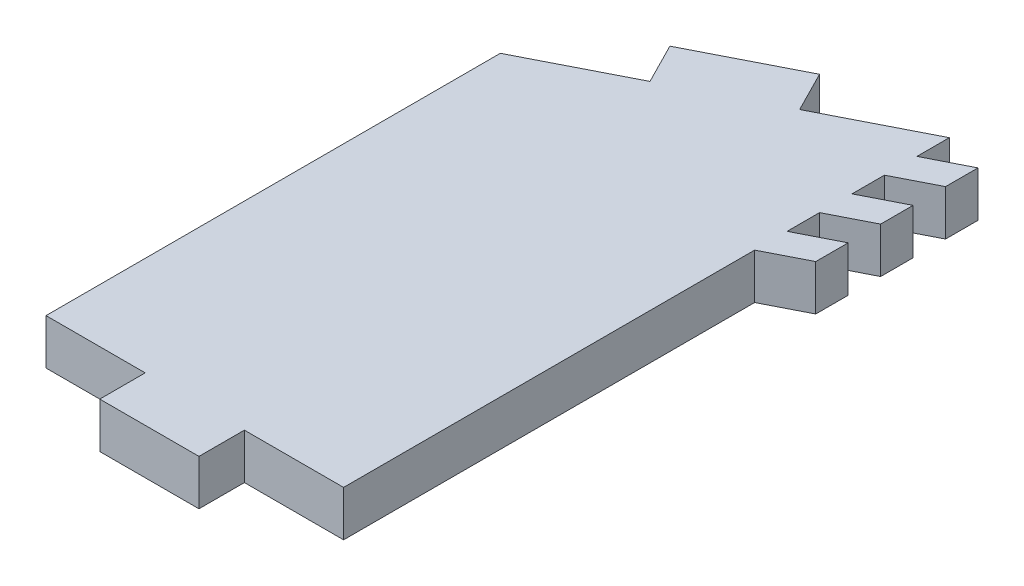
ISO-10303-21;
HEADER;
FILE_DESCRIPTION(('STEP AP214'),'2;1');
FILE_NAME('part.step','',(''),(''),'','','');
FILE_SCHEMA(('AUTOMOTIVE_DESIGN { 1 0 10303 214 1 1 1 1 }'));
ENDSEC;
DATA;
#1=APPLICATION_CONTEXT('core data for automotive mechanical design processes');
#2=APPLICATION_PROTOCOL_DEFINITION('international standard','automotive_design',2000,#1);
#3=PRODUCT_CONTEXT('',#1,'mechanical');
#4=PRODUCT('Part','Part','',(#3));
#5=PRODUCT_RELATED_PRODUCT_CATEGORY('part','',(#4));
#6=PRODUCT_DEFINITION_FORMATION('','',#4);
#7=PRODUCT_DEFINITION_CONTEXT('part definition',#1,'design');
#8=PRODUCT_DEFINITION('design','',#6,#7);
#9=PRODUCT_DEFINITION_SHAPE('','',#8);
#10=(LENGTH_UNIT() NAMED_UNIT(*) SI_UNIT(.MILLI.,.METRE.));
#11=(NAMED_UNIT(*) PLANE_ANGLE_UNIT() SI_UNIT($,.RADIAN.));
#12=(NAMED_UNIT(*) SI_UNIT($,.STERADIAN.) SOLID_ANGLE_UNIT());
#13=UNCERTAINTY_MEASURE_WITH_UNIT(LENGTH_MEASURE(1.E-05),#10,'distance_accuracy_value','');
#14=(GEOMETRIC_REPRESENTATION_CONTEXT(3) GLOBAL_UNCERTAINTY_ASSIGNED_CONTEXT((#13)) GLOBAL_UNIT_ASSIGNED_CONTEXT((#10,
#11,#12)) REPRESENTATION_CONTEXT('',''));
#15=CARTESIAN_POINT('',(0.,0.,0.));
#16=DIRECTION('',(0.,0.,1.));
#17=DIRECTION('',(1.,0.,0.));
#18=AXIS2_PLACEMENT_3D('',#15,#16,#17);
#19=CARTESIAN_POINT('',(19.65,3.,-40.));
#20=DIRECTION('',(-1.,0.,0.));
#21=DIRECTION('',(0.,0.,1.));
#22=AXIS2_PLACEMENT_3D('',#19,#20,#21);
#23=PLANE('',#22);
#24=DIRECTION('',(0.,0.,-1.));
#25=VECTOR('',#24,1.);
#26=CARTESIAN_POINT('',(19.65,0.,-40.));
#27=LINE('',#26,#25);
#28=CARTESIAN_POINT('',(19.65,0.,-33.5714281428571));
#29=VERTEX_POINT('',#28);
#30=CARTESIAN_POINT('',(19.65,0.,-35.7142851428571));
#31=VERTEX_POINT('',#30);
#32=EDGE_CURVE('E440',#29,#31,#27,.T.);
#33=ORIENTED_EDGE('',*,*,#32,.T.);
#34=DIRECTION('',(0.,-1.,0.));
#35=VECTOR('',#34,1.);
#36=CARTESIAN_POINT('',(19.65,3.,-35.7142851428571));
#37=LINE('',#36,#35);
#38=CARTESIAN_POINT('',(19.65,3.,-35.7142851428571));
#39=VERTEX_POINT('',#38);
#40=EDGE_CURVE('E67',#39,#31,#37,.T.);
#41=ORIENTED_EDGE('',*,*,#40,.F.);
#42=DIRECTION('',(0.,0.,-1.));
#43=VECTOR('',#42,1.);
#44=CARTESIAN_POINT('',(19.65,3.,0.));
#45=LINE('',#44,#43);
#46=CARTESIAN_POINT('',(19.65,3.,-33.5714281428571));
#47=VERTEX_POINT('',#46);
#48=EDGE_CURVE('E438',#47,#39,#45,.T.);
#49=ORIENTED_EDGE('',*,*,#48,.F.);
#50=DIRECTION('',(0.,-1.,0.));
#51=VECTOR('',#50,1.);
#52=CARTESIAN_POINT('',(19.65,3.,-33.5714281428571));
#53=LINE('',#52,#51);
#54=EDGE_CURVE('E240',#47,#29,#53,.T.);
#55=ORIENTED_EDGE('',*,*,#54,.T.);
#56=EDGE_LOOP('',(#33,#41,#49,#55));
#57=FACE_BOUND('',#56,.T.);
#58=ADVANCED_FACE('F44',(#57),#23,.F.);
#59=CARTESIAN_POINT('',(19.65,0.,-29.2857141428571));
#60=VERTEX_POINT('',#59);
#61=CARTESIAN_POINT('',(19.65,0.,-31.4285711428571));
#62=VERTEX_POINT('',#61);
#63=EDGE_CURVE('E374',#60,#62,#27,.T.);
#64=ORIENTED_EDGE('',*,*,#63,.T.);
#65=DIRECTION('',(0.,-1.,0.));
#66=VECTOR('',#65,1.);
#67=CARTESIAN_POINT('',(19.65,3.,-31.4285711428571));
#68=LINE('',#67,#66);
#69=CARTESIAN_POINT('',(19.65,3.,-31.4285711428571));
#70=VERTEX_POINT('',#69);
#71=EDGE_CURVE('E235',#70,#62,#68,.T.);
#72=ORIENTED_EDGE('',*,*,#71,.F.);
#73=CARTESIAN_POINT('',(19.65,3.,-29.2857141428571));
#74=VERTEX_POINT('',#73);
#75=EDGE_CURVE('E358',#74,#70,#45,.T.);
#76=ORIENTED_EDGE('',*,*,#75,.F.);
#77=DIRECTION('',(0.,-1.,0.));
#78=VECTOR('',#77,1.);
#79=CARTESIAN_POINT('',(19.65,3.,-29.2857141428571));
#80=LINE('',#79,#78);
#81=EDGE_CURVE('E294',#74,#60,#80,.T.);
#82=ORIENTED_EDGE('',*,*,#81,.T.);
#83=EDGE_LOOP('',(#64,#72,#76,#82));
#84=FACE_BOUND('',#83,.T.);
#85=ADVANCED_FACE('F463',(#84),#23,.F.);
#86=CARTESIAN_POINT('',(0.,3.,0.));
#87=DIRECTION('',(0.,0.,-1.));
#88=DIRECTION('',(-1.,0.,0.));
#89=AXIS2_PLACEMENT_3D('',#86,#87,#88);
#90=PLANE('',#89);
#91=DIRECTION('',(0.,-1.,0.));
#92=VECTOR('',#91,1.);
#93=CARTESIAN_POINT('',(6.55,3.,0.));
#94=LINE('',#93,#92);
#95=CARTESIAN_POINT('',(6.55,3.,0.));
#96=VERTEX_POINT('',#95);
#97=CARTESIAN_POINT('',(6.55,0.,0.));
#98=VERTEX_POINT('',#97);
#99=EDGE_CURVE('E260',#96,#98,#94,.T.);
#100=ORIENTED_EDGE('',*,*,#99,.F.);
#101=DIRECTION('',(1.,0.,0.));
#102=VECTOR('',#101,1.);
#103=CARTESIAN_POINT('',(0.,3.,0.));
#104=LINE('',#103,#102);
#105=CARTESIAN_POINT('',(0.,3.,0.));
#106=VERTEX_POINT('',#105);
#107=EDGE_CURVE('E351',#106,#96,#104,.T.);
#108=ORIENTED_EDGE('',*,*,#107,.F.);
#109=DIRECTION('',(0.,-1.,0.));
#110=VECTOR('',#109,1.);
#111=CARTESIAN_POINT('',(0.,3.,0.));
#112=LINE('',#111,#110);
#113=CARTESIAN_POINT('',(0.,0.,0.));
#114=VERTEX_POINT('',#113);
#115=EDGE_CURVE('E11',#106,#114,#112,.T.);
#116=ORIENTED_EDGE('',*,*,#115,.T.);
#117=DIRECTION('',(1.,0.,0.));
#118=VECTOR('',#117,1.);
#119=CARTESIAN_POINT('',(0.,0.,0.));
#120=LINE('',#119,#118);
#121=EDGE_CURVE('E366',#114,#98,#120,.T.);
#122=ORIENTED_EDGE('',*,*,#121,.T.);
#123=EDGE_LOOP('',(#100,#108,#116,#122));
#124=FACE_BOUND('',#123,.T.);
#125=ADVANCED_FACE('F412',(#124),#90,.F.);
#126=DIRECTION('',(0.,-1.,0.));
#127=VECTOR('',#126,1.);
#128=CARTESIAN_POINT('',(19.65,3.,-27.1428571428571));
#129=LINE('',#128,#127);
#130=CARTESIAN_POINT('',(19.65,3.,-27.1428571428571));
#131=VERTEX_POINT('',#130);
#132=CARTESIAN_POINT('',(19.65,0.,-27.1428571428571));
#133=VERTEX_POINT('',#132);
#134=EDGE_CURVE('E287',#131,#133,#129,.T.);
#135=ORIENTED_EDGE('',*,*,#134,.F.);
#136=CARTESIAN_POINT('',(19.65,3.,0.));
#137=VERTEX_POINT('',#136);
#138=EDGE_CURVE('E354',#137,#131,#45,.T.);
#139=ORIENTED_EDGE('',*,*,#138,.F.);
#140=DIRECTION('',(0.,-1.,0.));
#141=VECTOR('',#140,1.);
#142=CARTESIAN_POINT('',(19.65,3.,0.));
#143=LINE('',#142,#141);
#144=CARTESIAN_POINT('',(19.65,0.,0.));
#145=VERTEX_POINT('',#144);
#146=EDGE_CURVE('E52',#137,#145,#143,.T.);
#147=ORIENTED_EDGE('',*,*,#146,.T.);
#148=EDGE_CURVE('E370',#145,#133,#27,.T.);
#149=ORIENTED_EDGE('',*,*,#148,.T.);
#150=EDGE_LOOP('',(#135,#139,#147,#149));
#151=FACE_BOUND('',#150,.T.);
#152=ADVANCED_FACE('F386',(#151),#23,.F.);
#153=CARTESIAN_POINT('',(0.,3.,-30.));
#154=DIRECTION('',(0.453552054603838,0.,0.891229787296541));
#155=DIRECTION('',(0.891229787296541,0.,-0.453552054603838));
#156=AXIS2_PLACEMENT_3D('',#153,#154,#155);
#157=PLANE('',#156);
#158=DIRECTION('',(0.,-1.,0.));
#159=VECTOR('',#158,1.);
#160=CARTESIAN_POINT('',(13.0994610633704,3.,-36.6663923986618));
#161=LINE('',#160,#159);
#162=CARTESIAN_POINT('',(13.0994610633704,3.,-36.6663923986618));
#163=VERTEX_POINT('',#162);
#164=CARTESIAN_POINT('',(13.0994610633704,0.,-36.6663923986618));
#165=VERTEX_POINT('',#164);
#166=EDGE_CURVE('E337',#163,#165,#161,.T.);
#167=ORIENTED_EDGE('',*,*,#166,.F.);
#168=DIRECTION('',(-0.891229787296541,0.,0.453552054603838));
#169=VECTOR('',#168,1.);
#170=CARTESIAN_POINT('',(0.,3.,-30.));
#171=LINE('',#170,#169);
#172=CARTESIAN_POINT('',(19.65,3.,-40.));
#173=VERTEX_POINT('',#172);
#174=EDGE_CURVE('E359',#173,#163,#171,.T.);
#175=ORIENTED_EDGE('',*,*,#174,.F.);
#176=DIRECTION('',(0.,-1.,0.));
#177=VECTOR('',#176,1.);
#178=CARTESIAN_POINT('',(19.65,3.,-40.));
#179=LINE('',#178,#177);
#180=CARTESIAN_POINT('',(19.65,0.,-40.));
#181=VERTEX_POINT('',#180);
#182=EDGE_CURVE('E379',#173,#181,#179,.T.);
#183=ORIENTED_EDGE('',*,*,#182,.T.);
#184=DIRECTION('',(-0.891229787296541,0.,0.453552054603838));
#185=VECTOR('',#184,1.);
#186=CARTESIAN_POINT('',(0.,0.,-30.));
#187=LINE('',#186,#185);
#188=EDGE_CURVE('E350',#181,#165,#187,.T.);
#189=ORIENTED_EDGE('',*,*,#188,.T.);
#190=EDGE_LOOP('',(#167,#175,#183,#189));
#191=FACE_BOUND('',#190,.T.);
#192=ADVANCED_FACE('F436',(#191),#157,.F.);
#193=CARTESIAN_POINT('',(0.,3.,0.));
#194=DIRECTION('',(1.,0.,0.));
#195=DIRECTION('',(0.,0.,-1.));
#196=AXIS2_PLACEMENT_3D('',#193,#194,#195);
#197=PLANE('',#196);
#198=DIRECTION('',(0.,0.,1.));
#199=VECTOR('',#198,1.);
#200=CARTESIAN_POINT('',(0.,0.,0.));
#201=LINE('',#200,#199);
#202=CARTESIAN_POINT('',(0.,0.,-30.));
#203=VERTEX_POINT('',#202);
#204=EDGE_CURVE('E339',#203,#114,#201,.T.);
#205=ORIENTED_EDGE('',*,*,#204,.T.);
#206=ORIENTED_EDGE('',*,*,#115,.F.);
#207=DIRECTION('',(0.,0.,1.));
#208=VECTOR('',#207,1.);
#209=CARTESIAN_POINT('',(0.,3.,0.));
#210=LINE('',#209,#208);
#211=CARTESIAN_POINT('',(0.,3.,-30.));
#212=VERTEX_POINT('',#211);
#213=EDGE_CURVE('E346',#212,#106,#210,.T.);
#214=ORIENTED_EDGE('',*,*,#213,.F.);
#215=DIRECTION('',(0.,-1.,0.));
#216=VECTOR('',#215,1.);
#217=CARTESIAN_POINT('',(0.,3.,-30.));
#218=LINE('',#217,#216);
#219=EDGE_CURVE('E362',#212,#203,#218,.T.);
#220=ORIENTED_EDGE('',*,*,#219,.T.);
#221=EDGE_LOOP('',(#205,#206,#214,#220));
#222=FACE_BOUND('',#221,.T.);
#223=ADVANCED_FACE('F46',(#222),#197,.F.);
#224=CARTESIAN_POINT('',(13.1,3.,0.));
#225=VERTEX_POINT('',#224);
#226=EDGE_CURVE('E349',#225,#137,#104,.T.);
#227=ORIENTED_EDGE('',*,*,#226,.F.);
#228=DIRECTION('',(0.,-1.,0.));
#229=VECTOR('',#228,1.);
#230=CARTESIAN_POINT('',(13.1,3.,0.));
#231=LINE('',#230,#229);
#232=CARTESIAN_POINT('',(13.1,0.,0.));
#233=VERTEX_POINT('',#232);
#234=EDGE_CURVE('E268',#225,#233,#231,.T.);
#235=ORIENTED_EDGE('',*,*,#234,.T.);
#236=EDGE_CURVE('E365',#233,#145,#120,.T.);
#237=ORIENTED_EDGE('',*,*,#236,.T.);
#238=ORIENTED_EDGE('',*,*,#146,.F.);
#239=EDGE_LOOP('',(#227,#235,#237,#238));
#240=FACE_BOUND('',#239,.T.);
#241=ADVANCED_FACE('F390',(#240),#90,.F.);
#242=CARTESIAN_POINT('',(19.65,3.,-37.8571421428571));
#243=VERTEX_POINT('',#242);
#244=EDGE_CURVE('E59',#243,#173,#45,.T.);
#245=ORIENTED_EDGE('',*,*,#244,.F.);
#246=DIRECTION('',(0.,-1.,0.));
#247=VECTOR('',#246,1.);
#248=CARTESIAN_POINT('',(19.65,3.,-37.8571421428571));
#249=LINE('',#248,#247);
#250=CARTESIAN_POINT('',(19.65,0.,-37.8571421428571));
#251=VERTEX_POINT('',#250);
#252=EDGE_CURVE('E238',#243,#251,#249,.T.);
#253=ORIENTED_EDGE('',*,*,#252,.T.);
#254=EDGE_CURVE('E369',#251,#181,#27,.T.);
#255=ORIENTED_EDGE('',*,*,#254,.T.);
#256=ORIENTED_EDGE('',*,*,#182,.F.);
#257=EDGE_LOOP('',(#245,#253,#255,#256));
#258=FACE_BOUND('',#257,.T.);
#259=ADVANCED_FACE('F439',(#258),#23,.F.);
#260=CARTESIAN_POINT('',(6.54892212674084,3.,-33.3327847973236));
#261=VERTEX_POINT('',#260);
#262=EDGE_CURVE('E357',#261,#212,#171,.T.);
#263=ORIENTED_EDGE('',*,*,#262,.F.);
#264=DIRECTION('',(0.,-1.,0.));
#265=VECTOR('',#264,1.);
#266=CARTESIAN_POINT('',(6.54892212674084,3.,-33.3327847973236));
#267=LINE('',#266,#265);
#268=CARTESIAN_POINT('',(6.54892212674085,0.,-33.3327847973236));
#269=VERTEX_POINT('',#268);
#270=EDGE_CURVE('E329',#261,#269,#267,.T.);
#271=ORIENTED_EDGE('',*,*,#270,.T.);
#272=EDGE_CURVE('E373',#269,#203,#187,.T.);
#273=ORIENTED_EDGE('',*,*,#272,.T.);
#274=ORIENTED_EDGE('',*,*,#219,.F.);
#275=EDGE_LOOP('',(#263,#271,#273,#274));
#276=FACE_BOUND('',#275,.T.);
#277=ADVANCED_FACE('F421',(#276),#157,.F.);
#278=CARTESIAN_POINT('',(0.,3.,0.));
#279=DIRECTION('',(0.,-1.,0.));
#280=DIRECTION('',(0.,0.,-1.));
#281=AXIS2_PLACEMENT_3D('',#278,#279,#280);
#282=PLANE('',#281);
#283=ORIENTED_EDGE('',*,*,#213,.T.);
#284=ORIENTED_EDGE('',*,*,#107,.T.);
#285=DIRECTION('',(0.,0.,-1.));
#286=VECTOR('',#285,1.);
#287=CARTESIAN_POINT('',(6.55,3.,0.));
#288=LINE('',#287,#286);
#289=CARTESIAN_POINT('',(6.55,3.,3.00000000000004));
#290=VERTEX_POINT('',#289);
#291=EDGE_CURVE('E271',#290,#96,#288,.T.);
#292=ORIENTED_EDGE('',*,*,#291,.F.);
#293=DIRECTION('',(-1.,0.,0.));
#294=VECTOR('',#293,1.);
#295=CARTESIAN_POINT('',(6.55,3.,3.00000000000004));
#296=LINE('',#295,#294);
#297=CARTESIAN_POINT('',(13.1,3.,3.00000000000008));
#298=VERTEX_POINT('',#297);
#299=EDGE_CURVE('E289',#298,#290,#296,.T.);
#300=ORIENTED_EDGE('',*,*,#299,.F.);
#301=DIRECTION('',(0.,0.,1.));
#302=VECTOR('',#301,1.);
#303=CARTESIAN_POINT('',(13.1,3.,0.));
#304=LINE('',#303,#302);
#305=EDGE_CURVE('E281',#225,#298,#304,.T.);
#306=ORIENTED_EDGE('',*,*,#305,.F.);
#307=ORIENTED_EDGE('',*,*,#226,.T.);
#308=ORIENTED_EDGE('',*,*,#138,.T.);
#309=DIRECTION('',(-0.891244110910059,0.,0.45352390760371));
#310=VECTOR('',#309,1.);
#311=CARTESIAN_POINT('',(19.65,3.,-27.1428571428571));
#312=LINE('',#311,#310);
#313=CARTESIAN_POINT('',(22.3237323327302,3.,-28.5034288656682));
#314=VERTEX_POINT('',#313);
#315=EDGE_CURVE('E297',#314,#131,#312,.T.);
#316=ORIENTED_EDGE('',*,*,#315,.F.);
#317=DIRECTION('',(0.,0.,1.));
#318=VECTOR('',#317,1.);
#319=CARTESIAN_POINT('',(22.3237323327302,3.,-28.5034288656682));
#320=LINE('',#319,#318);
#321=CARTESIAN_POINT('',(22.3237323327302,3.,-30.6462858656682));
#322=VERTEX_POINT('',#321);
#323=EDGE_CURVE('E315',#322,#314,#320,.T.);
#324=ORIENTED_EDGE('',*,*,#323,.F.);
#325=DIRECTION('',(0.891244110910059,0.,-0.45352390760371));
#326=VECTOR('',#325,1.);
#327=CARTESIAN_POINT('',(19.65,3.,-29.2857141428571));
#328=LINE('',#327,#326);
#329=EDGE_CURVE('E307',#74,#322,#328,.T.);
#330=ORIENTED_EDGE('',*,*,#329,.F.);
#331=ORIENTED_EDGE('',*,*,#75,.T.);
#332=DIRECTION('',(-0.891244110910059,0.,0.45352390760371));
#333=VECTOR('',#332,1.);
#334=CARTESIAN_POINT('',(19.65,3.,-31.4285711428571));
#335=LINE('',#334,#333);
#336=CARTESIAN_POINT('',(22.3237323327302,3.,-32.7891428656682));
#337=VERTEX_POINT('',#336);
#338=EDGE_CURVE('E243',#337,#70,#335,.T.);
#339=ORIENTED_EDGE('',*,*,#338,.F.);
#340=DIRECTION('',(0.,0.,1.));
#341=VECTOR('',#340,1.);
#342=CARTESIAN_POINT('',(22.3237323327302,3.,-32.7891428656682));
#343=LINE('',#342,#341);
#344=CARTESIAN_POINT('',(22.3237323327302,3.,-34.9319998656682));
#345=VERTEX_POINT('',#344);
#346=EDGE_CURVE('E263',#345,#337,#343,.T.);
#347=ORIENTED_EDGE('',*,*,#346,.F.);
#348=DIRECTION('',(0.891244110910059,0.,-0.45352390760371));
#349=VECTOR('',#348,1.);
#350=CARTESIAN_POINT('',(19.65,3.,-33.5714281428571));
#351=LINE('',#350,#349);
#352=EDGE_CURVE('E254',#47,#345,#351,.T.);
#353=ORIENTED_EDGE('',*,*,#352,.F.);
#354=ORIENTED_EDGE('',*,*,#48,.T.);
#355=DIRECTION('',(-0.891244110910059,0.,0.45352390760371));
#356=VECTOR('',#355,1.);
#357=CARTESIAN_POINT('',(19.65,3.,-35.7142851428571));
#358=LINE('',#357,#356);
#359=CARTESIAN_POINT('',(22.3237323327302,3.,-37.0748568656682));
#360=VERTEX_POINT('',#359);
#361=EDGE_CURVE('E236',#360,#39,#358,.T.);
#362=ORIENTED_EDGE('',*,*,#361,.F.);
#363=DIRECTION('',(0.,0.,1.));
#364=VECTOR('',#363,1.);
#365=CARTESIAN_POINT('',(22.3237323327302,3.,-37.0748568656682));
#366=LINE('',#365,#364);
#367=CARTESIAN_POINT('',(22.3237323327302,3.,-39.2177138656682));
#368=VERTEX_POINT('',#367);
#369=EDGE_CURVE('E212',#368,#360,#366,.T.);
#370=ORIENTED_EDGE('',*,*,#369,.F.);
#371=DIRECTION('',(0.89124411091006,0.,-0.453523907603708));
#372=VECTOR('',#371,1.);
#373=CARTESIAN_POINT('',(19.65,3.,-37.8571421428571));
#374=LINE('',#373,#372);
#375=EDGE_CURVE('E228',#243,#368,#374,.T.);
#376=ORIENTED_EDGE('',*,*,#375,.F.);
#377=ORIENTED_EDGE('',*,*,#244,.T.);
#378=ORIENTED_EDGE('',*,*,#174,.T.);
#379=DIRECTION('',(0.453552054603838,0.,0.891229787296541));
#380=VECTOR('',#379,1.);
#381=CARTESIAN_POINT('',(13.0994610633704,3.,-36.6663923986618));
#382=LINE('',#381,#380);
#383=CARTESIAN_POINT('',(11.7388048995589,3.,-39.3400817605514));
#384=VERTEX_POINT('',#383);
#385=EDGE_CURVE('E327',#384,#163,#382,.T.);
#386=ORIENTED_EDGE('',*,*,#385,.F.);
#387=DIRECTION('',(0.891229787296541,0.,-0.453552054603838));
#388=VECTOR('',#387,1.);
#389=CARTESIAN_POINT('',(11.7388048995589,3.,-39.3400817605514));
#390=LINE('',#389,#388);
#391=CARTESIAN_POINT('',(5.18826596292934,3.,-36.0064741592132));
#392=VERTEX_POINT('',#391);
#393=EDGE_CURVE('E323',#392,#384,#390,.T.);
#394=ORIENTED_EDGE('',*,*,#393,.F.);
#395=DIRECTION('',(-0.453552054603838,0.,-0.891229787296541));
#396=VECTOR('',#395,1.);
#397=CARTESIAN_POINT('',(6.54892212674084,3.,-33.3327847973236));
#398=LINE('',#397,#396);
#399=EDGE_CURVE('E320',#261,#392,#398,.T.);
#400=ORIENTED_EDGE('',*,*,#399,.F.);
#401=ORIENTED_EDGE('',*,*,#262,.T.);
#402=EDGE_LOOP('',(#283,#284,#292,#300,#306,#307,#308,#316,#324,#330,#331,#339,#347,#353,#354,
#362,#370,#376,#377,#378,#386,#394,#400,#401));
#403=FACE_BOUND('',#402,.T.);
#404=ADVANCED_FACE('F398',(#403),#282,.F.);
#405=CARTESIAN_POINT('',(0.,0.,0.));
#406=DIRECTION('',(0.,-1.,0.));
#407=DIRECTION('',(0.,0.,-1.));
#408=AXIS2_PLACEMENT_3D('',#405,#406,#407);
#409=PLANE('',#408);
#410=ORIENTED_EDGE('',*,*,#204,.F.);
#411=ORIENTED_EDGE('',*,*,#272,.F.);
#412=DIRECTION('',(-0.453552054603838,0.,-0.891229787296541));
#413=VECTOR('',#412,1.);
#414=CARTESIAN_POINT('',(6.54892212674084,0.,-33.3327847973236));
#415=LINE('',#414,#413);
#416=CARTESIAN_POINT('',(5.18826596292934,0.,-36.0064741592132));
#417=VERTEX_POINT('',#416);
#418=EDGE_CURVE('E313',#269,#417,#415,.T.);
#419=ORIENTED_EDGE('',*,*,#418,.T.);
#420=DIRECTION('',(0.891229787296541,0.,-0.453552054603838));
#421=VECTOR('',#420,1.);
#422=CARTESIAN_POINT('',(11.7388048995589,0.,-39.3400817605514));
#423=LINE('',#422,#421);
#424=CARTESIAN_POINT('',(11.7388048995589,0.,-39.3400817605514));
#425=VERTEX_POINT('',#424);
#426=EDGE_CURVE('E332',#417,#425,#423,.T.);
#427=ORIENTED_EDGE('',*,*,#426,.T.);
#428=DIRECTION('',(0.453552054603838,0.,0.891229787296541));
#429=VECTOR('',#428,1.);
#430=CARTESIAN_POINT('',(13.0994610633704,0.,-36.6663923986618));
#431=LINE('',#430,#429);
#432=EDGE_CURVE('E324',#425,#165,#431,.T.);
#433=ORIENTED_EDGE('',*,*,#432,.T.);
#434=ORIENTED_EDGE('',*,*,#188,.F.);
#435=ORIENTED_EDGE('',*,*,#254,.F.);
#436=DIRECTION('',(0.89124411091006,0.,-0.453523907603708));
#437=VECTOR('',#436,1.);
#438=CARTESIAN_POINT('',(19.65,0.,-37.8571421428571));
#439=LINE('',#438,#437);
#440=CARTESIAN_POINT('',(22.3237323327302,0.,-39.2177138656682));
#441=VERTEX_POINT('',#440);
#442=EDGE_CURVE('E225',#251,#441,#439,.T.);
#443=ORIENTED_EDGE('',*,*,#442,.T.);
#444=DIRECTION('',(0.,0.,1.));
#445=VECTOR('',#444,1.);
#446=CARTESIAN_POINT('',(22.3237323327302,0.,-37.0748568656682));
#447=LINE('',#446,#445);
#448=CARTESIAN_POINT('',(22.3237323327302,0.,-37.0748568656682));
#449=VERTEX_POINT('',#448);
#450=EDGE_CURVE('E209',#441,#449,#447,.T.);
#451=ORIENTED_EDGE('',*,*,#450,.T.);
#452=DIRECTION('',(-0.891244110910059,0.,0.45352390760371));
#453=VECTOR('',#452,1.);
#454=CARTESIAN_POINT('',(19.65,0.,-35.7142851428571));
#455=LINE('',#454,#453);
#456=EDGE_CURVE('E223',#449,#31,#455,.T.);
#457=ORIENTED_EDGE('',*,*,#456,.T.);
#458=ORIENTED_EDGE('',*,*,#32,.F.);
#459=DIRECTION('',(0.891244110910059,0.,-0.45352390760371));
#460=VECTOR('',#459,1.);
#461=CARTESIAN_POINT('',(19.65,0.,-33.5714281428571));
#462=LINE('',#461,#460);
#463=CARTESIAN_POINT('',(22.3237323327302,0.,-34.9319998656682));
#464=VERTEX_POINT('',#463);
#465=EDGE_CURVE('E257',#29,#464,#462,.T.);
#466=ORIENTED_EDGE('',*,*,#465,.T.);
#467=DIRECTION('',(0.,0.,1.));
#468=VECTOR('',#467,1.);
#469=CARTESIAN_POINT('',(22.3237323327302,0.,-32.7891428656682));
#470=LINE('',#469,#468);
#471=CARTESIAN_POINT('',(22.3237323327302,0.,-32.7891428656682));
#472=VERTEX_POINT('',#471);
#473=EDGE_CURVE('E253',#464,#472,#470,.T.);
#474=ORIENTED_EDGE('',*,*,#473,.T.);
#475=DIRECTION('',(-0.891244110910059,0.,0.45352390760371));
#476=VECTOR('',#475,1.);
#477=CARTESIAN_POINT('',(19.65,0.,-31.4285711428571));
#478=LINE('',#477,#476);
#479=EDGE_CURVE('E250',#472,#62,#478,.T.);
#480=ORIENTED_EDGE('',*,*,#479,.T.);
#481=ORIENTED_EDGE('',*,*,#63,.F.);
#482=DIRECTION('',(0.891244110910059,0.,-0.45352390760371));
#483=VECTOR('',#482,1.);
#484=CARTESIAN_POINT('',(19.65,0.,-29.2857141428571));
#485=LINE('',#484,#483);
#486=CARTESIAN_POINT('',(22.3237323327302,0.,-30.6462858656682));
#487=VERTEX_POINT('',#486);
#488=EDGE_CURVE('E310',#60,#487,#485,.T.);
#489=ORIENTED_EDGE('',*,*,#488,.T.);
#490=DIRECTION('',(0.,0.,1.));
#491=VECTOR('',#490,1.);
#492=CARTESIAN_POINT('',(22.3237323327302,0.,-28.5034288656682));
#493=LINE('',#492,#491);
#494=CARTESIAN_POINT('',(22.3237323327302,0.,-28.5034288656682));
#495=VERTEX_POINT('',#494);
#496=EDGE_CURVE('E306',#487,#495,#493,.T.);
#497=ORIENTED_EDGE('',*,*,#496,.T.);
#498=DIRECTION('',(-0.891244110910059,0.,0.45352390760371));
#499=VECTOR('',#498,1.);
#500=CARTESIAN_POINT('',(19.65,0.,-27.1428571428571));
#501=LINE('',#500,#499);
#502=EDGE_CURVE('E303',#495,#133,#501,.T.);
#503=ORIENTED_EDGE('',*,*,#502,.T.);
#504=ORIENTED_EDGE('',*,*,#148,.F.);
#505=ORIENTED_EDGE('',*,*,#236,.F.);
#506=DIRECTION('',(0.,0.,1.));
#507=VECTOR('',#506,1.);
#508=CARTESIAN_POINT('',(13.1,0.,0.));
#509=LINE('',#508,#507);
#510=CARTESIAN_POINT('',(13.1,0.,3.00000000000008));
#511=VERTEX_POINT('',#510);
#512=EDGE_CURVE('E284',#233,#511,#509,.T.);
#513=ORIENTED_EDGE('',*,*,#512,.T.);
#514=DIRECTION('',(-1.,0.,0.));
#515=VECTOR('',#514,1.);
#516=CARTESIAN_POINT('',(6.55,0.,3.00000000000004));
#517=LINE('',#516,#515);
#518=CARTESIAN_POINT('',(6.55,0.,3.00000000000004));
#519=VERTEX_POINT('',#518);
#520=EDGE_CURVE('E280',#511,#519,#517,.T.);
#521=ORIENTED_EDGE('',*,*,#520,.T.);
#522=DIRECTION('',(0.,0.,-1.));
#523=VECTOR('',#522,1.);
#524=CARTESIAN_POINT('',(6.55,0.,0.));
#525=LINE('',#524,#523);
#526=EDGE_CURVE('E277',#519,#98,#525,.T.);
#527=ORIENTED_EDGE('',*,*,#526,.T.);
#528=ORIENTED_EDGE('',*,*,#121,.F.);
#529=EDGE_LOOP('',(#410,#411,#419,#427,#433,#434,#435,#443,#451,#457,#458,#466,#474,#480,#481,
#489,#497,#503,#504,#505,#513,#521,#527,#528));
#530=FACE_BOUND('',#529,.T.);
#531=ADVANCED_FACE('F222',(#530),#409,.T.);
#532=CARTESIAN_POINT('',(13.0994610633704,3.,-36.6663923986618));
#533=DIRECTION('',(0.891229787296541,0.,-0.453552054603838));
#534=DIRECTION('',(-0.453552054603838,0.,-0.891229787296541));
#535=AXIS2_PLACEMENT_3D('',#532,#533,#534);
#536=PLANE('',#535);
#537=ORIENTED_EDGE('',*,*,#432,.F.);
#538=DIRECTION('',(0.,-1.,0.));
#539=VECTOR('',#538,1.);
#540=CARTESIAN_POINT('',(11.7388048995589,3.,-39.3400817605514));
#541=LINE('',#540,#539);
#542=EDGE_CURVE('E340',#384,#425,#541,.T.);
#543=ORIENTED_EDGE('',*,*,#542,.F.);
#544=ORIENTED_EDGE('',*,*,#385,.T.);
#545=ORIENTED_EDGE('',*,*,#166,.T.);
#546=EDGE_LOOP('',(#537,#543,#544,#545));
#547=FACE_BOUND('',#546,.T.);
#548=ADVANCED_FACE('F432',(#547),#536,.T.);
#549=CARTESIAN_POINT('',(11.7388048995589,3.,-39.3400817605514));
#550=DIRECTION('',(-0.453552054603838,0.,-0.891229787296541));
#551=DIRECTION('',(-0.891229787296541,0.,0.453552054603838));
#552=AXIS2_PLACEMENT_3D('',#549,#550,#551);
#553=PLANE('',#552);
#554=ORIENTED_EDGE('',*,*,#426,.F.);
#555=DIRECTION('',(0.,-1.,0.));
#556=VECTOR('',#555,1.);
#557=CARTESIAN_POINT('',(5.18826596292934,3.,-36.0064741592132));
#558=LINE('',#557,#556);
#559=EDGE_CURVE('E342',#392,#417,#558,.T.);
#560=ORIENTED_EDGE('',*,*,#559,.F.);
#561=ORIENTED_EDGE('',*,*,#393,.T.);
#562=ORIENTED_EDGE('',*,*,#542,.T.);
#563=EDGE_LOOP('',(#554,#560,#561,#562));
#564=FACE_BOUND('',#563,.T.);
#565=ADVANCED_FACE('F428',(#564),#553,.T.);
#566=CARTESIAN_POINT('',(6.54892212674084,3.,-33.3327847973236));
#567=DIRECTION('',(-0.891229787296541,0.,0.453552054603838));
#568=DIRECTION('',(0.453552054603838,0.,0.891229787296541));
#569=AXIS2_PLACEMENT_3D('',#566,#567,#568);
#570=PLANE('',#569);
#571=ORIENTED_EDGE('',*,*,#418,.F.);
#572=ORIENTED_EDGE('',*,*,#270,.F.);
#573=ORIENTED_EDGE('',*,*,#399,.T.);
#574=ORIENTED_EDGE('',*,*,#559,.T.);
#575=EDGE_LOOP('',(#571,#572,#573,#574));
#576=FACE_BOUND('',#575,.T.);
#577=ADVANCED_FACE('F423',(#576),#570,.T.);
#578=CARTESIAN_POINT('',(19.65,3.,-27.1428571428571));
#579=DIRECTION('',(0.45352390760371,0.,0.891244110910059));
#580=DIRECTION('',(0.891244110910059,0.,-0.45352390760371));
#581=AXIS2_PLACEMENT_3D('',#578,#579,#580);
#582=PLANE('',#581);
#583=ORIENTED_EDGE('',*,*,#502,.F.);
#584=DIRECTION('',(0.,-1.,0.));
#585=VECTOR('',#584,1.);
#586=CARTESIAN_POINT('',(22.3237323327302,3.,-28.5034288656682));
#587=LINE('',#586,#585);
#588=EDGE_CURVE('E300',#314,#495,#587,.T.);
#589=ORIENTED_EDGE('',*,*,#588,.F.);
#590=ORIENTED_EDGE('',*,*,#315,.T.);
#591=ORIENTED_EDGE('',*,*,#134,.T.);
#592=EDGE_LOOP('',(#583,#589,#590,#591));
#593=FACE_BOUND('',#592,.T.);
#594=ADVANCED_FACE('F395',(#593),#582,.T.);
#595=CARTESIAN_POINT('',(22.3237323327302,3.,-28.5034288656682));
#596=DIRECTION('',(1.,0.,0.));
#597=DIRECTION('',(0.,0.,-1.));
#598=AXIS2_PLACEMENT_3D('',#595,#596,#597);
#599=PLANE('',#598);
#600=ORIENTED_EDGE('',*,*,#496,.F.);
#601=DIRECTION('',(0.,-1.,0.));
#602=VECTOR('',#601,1.);
#603=CARTESIAN_POINT('',(22.3237323327302,3.,-30.6462858656682));
#604=LINE('',#603,#602);
#605=EDGE_CURVE('E298',#322,#487,#604,.T.);
#606=ORIENTED_EDGE('',*,*,#605,.F.);
#607=ORIENTED_EDGE('',*,*,#323,.T.);
#608=ORIENTED_EDGE('',*,*,#588,.T.);
#609=EDGE_LOOP('',(#600,#606,#607,#608));
#610=FACE_BOUND('',#609,.T.);
#611=ADVANCED_FACE('F467',(#610),#599,.T.);
#612=CARTESIAN_POINT('',(19.65,3.,-29.2857141428571));
#613=DIRECTION('',(-0.45352390760371,0.,-0.891244110910059));
#614=DIRECTION('',(-0.891244110910059,0.,0.45352390760371));
#615=AXIS2_PLACEMENT_3D('',#612,#613,#614);
#616=PLANE('',#615);
#617=ORIENTED_EDGE('',*,*,#488,.F.);
#618=ORIENTED_EDGE('',*,*,#81,.F.);
#619=ORIENTED_EDGE('',*,*,#329,.T.);
#620=ORIENTED_EDGE('',*,*,#605,.T.);
#621=EDGE_LOOP('',(#617,#618,#619,#620));
#622=FACE_BOUND('',#621,.T.);
#623=ADVANCED_FACE('F465',(#622),#616,.T.);
#624=CARTESIAN_POINT('',(6.55,3.,0.));
#625=DIRECTION('',(-1.,0.,0.));
#626=DIRECTION('',(0.,0.,1.));
#627=AXIS2_PLACEMENT_3D('',#624,#625,#626);
#628=PLANE('',#627);
#629=ORIENTED_EDGE('',*,*,#526,.F.);
#630=DIRECTION('',(0.,-1.,0.));
#631=VECTOR('',#630,1.);
#632=CARTESIAN_POINT('',(6.55,3.,3.00000000000004));
#633=LINE('',#632,#631);
#634=EDGE_CURVE('E274',#290,#519,#633,.T.);
#635=ORIENTED_EDGE('',*,*,#634,.F.);
#636=ORIENTED_EDGE('',*,*,#291,.T.);
#637=ORIENTED_EDGE('',*,*,#99,.T.);
#638=EDGE_LOOP('',(#629,#635,#636,#637));
#639=FACE_BOUND('',#638,.T.);
#640=ADVANCED_FACE('F409',(#639),#628,.T.);
#641=CARTESIAN_POINT('',(6.55,3.,3.00000000000004));
#642=DIRECTION('',(0.,0.,1.));
#643=DIRECTION('',(1.,0.,0.));
#644=AXIS2_PLACEMENT_3D('',#641,#642,#643);
#645=PLANE('',#644);
#646=ORIENTED_EDGE('',*,*,#520,.F.);
#647=DIRECTION('',(0.,-1.,0.));
#648=VECTOR('',#647,1.);
#649=CARTESIAN_POINT('',(13.1,3.,3.00000000000008));
#650=LINE('',#649,#648);
#651=EDGE_CURVE('E272',#298,#511,#650,.T.);
#652=ORIENTED_EDGE('',*,*,#651,.F.);
#653=ORIENTED_EDGE('',*,*,#299,.T.);
#654=ORIENTED_EDGE('',*,*,#634,.T.);
#655=EDGE_LOOP('',(#646,#652,#653,#654));
#656=FACE_BOUND('',#655,.T.);
#657=ADVANCED_FACE('F613',(#656),#645,.T.);
#658=CARTESIAN_POINT('',(13.1,3.,0.));
#659=DIRECTION('',(1.,0.,0.));
#660=DIRECTION('',(0.,0.,-1.));
#661=AXIS2_PLACEMENT_3D('',#658,#659,#660);
#662=PLANE('',#661);
#663=ORIENTED_EDGE('',*,*,#512,.F.);
#664=ORIENTED_EDGE('',*,*,#234,.F.);
#665=ORIENTED_EDGE('',*,*,#305,.T.);
#666=ORIENTED_EDGE('',*,*,#651,.T.);
#667=EDGE_LOOP('',(#663,#664,#665,#666));
#668=FACE_BOUND('',#667,.T.);
#669=ADVANCED_FACE('F404',(#668),#662,.T.);
#670=CARTESIAN_POINT('',(19.65,3.,-31.4285711428571));
#671=DIRECTION('',(0.45352390760371,0.,0.891244110910059));
#672=DIRECTION('',(0.891244110910059,0.,-0.45352390760371));
#673=AXIS2_PLACEMENT_3D('',#670,#671,#672);
#674=PLANE('',#673);
#675=ORIENTED_EDGE('',*,*,#479,.F.);
#676=DIRECTION('',(0.,-1.,0.));
#677=VECTOR('',#676,1.);
#678=CARTESIAN_POINT('',(22.3237323327302,3.,-32.7891428656682));
#679=LINE('',#678,#677);
#680=EDGE_CURVE('E246',#337,#472,#679,.T.);
#681=ORIENTED_EDGE('',*,*,#680,.F.);
#682=ORIENTED_EDGE('',*,*,#338,.T.);
#683=ORIENTED_EDGE('',*,*,#71,.T.);
#684=EDGE_LOOP('',(#675,#681,#682,#683));
#685=FACE_BOUND('',#684,.T.);
#686=ADVANCED_FACE('F455',(#685),#674,.T.);
#687=CARTESIAN_POINT('',(22.3237323327302,3.,-32.7891428656682));
#688=DIRECTION('',(1.,0.,0.));
#689=DIRECTION('',(0.,0.,-1.));
#690=AXIS2_PLACEMENT_3D('',#687,#688,#689);
#691=PLANE('',#690);
#692=ORIENTED_EDGE('',*,*,#473,.F.);
#693=DIRECTION('',(0.,-1.,0.));
#694=VECTOR('',#693,1.);
#695=CARTESIAN_POINT('',(22.3237323327302,3.,-34.9319998656682));
#696=LINE('',#695,#694);
#697=EDGE_CURVE('E244',#345,#464,#696,.T.);
#698=ORIENTED_EDGE('',*,*,#697,.F.);
#699=ORIENTED_EDGE('',*,*,#346,.T.);
#700=ORIENTED_EDGE('',*,*,#680,.T.);
#701=EDGE_LOOP('',(#692,#698,#699,#700));
#702=FACE_BOUND('',#701,.T.);
#703=ADVANCED_FACE('F458',(#702),#691,.T.);
#704=CARTESIAN_POINT('',(19.65,3.,-33.5714281428571));
#705=DIRECTION('',(-0.45352390760371,0.,-0.891244110910059));
#706=DIRECTION('',(-0.891244110910059,0.,0.45352390760371));
#707=AXIS2_PLACEMENT_3D('',#704,#705,#706);
#708=PLANE('',#707);
#709=ORIENTED_EDGE('',*,*,#465,.F.);
#710=ORIENTED_EDGE('',*,*,#54,.F.);
#711=ORIENTED_EDGE('',*,*,#352,.T.);
#712=ORIENTED_EDGE('',*,*,#697,.T.);
#713=EDGE_LOOP('',(#709,#710,#711,#712));
#714=FACE_BOUND('',#713,.T.);
#715=ADVANCED_FACE('F461',(#714),#708,.T.);
#716=CARTESIAN_POINT('',(19.65,3.,-35.7142851428571));
#717=DIRECTION('',(0.45352390760371,0.,0.891244110910059));
#718=DIRECTION('',(0.891244110910059,0.,-0.45352390760371));
#719=AXIS2_PLACEMENT_3D('',#716,#717,#718);
#720=PLANE('',#719);
#721=ORIENTED_EDGE('',*,*,#456,.F.);
#722=DIRECTION('',(0.,-1.,0.));
#723=VECTOR('',#722,1.);
#724=CARTESIAN_POINT('',(22.3237323327302,3.,-37.0748568656682));
#725=LINE('',#724,#723);
#726=EDGE_CURVE('E206',#360,#449,#725,.T.);
#727=ORIENTED_EDGE('',*,*,#726,.F.);
#728=ORIENTED_EDGE('',*,*,#361,.T.);
#729=ORIENTED_EDGE('',*,*,#40,.T.);
#730=EDGE_LOOP('',(#721,#727,#728,#729));
#731=FACE_BOUND('',#730,.T.);
#732=ADVANCED_FACE('F227',(#731),#720,.T.);
#733=CARTESIAN_POINT('',(22.3237323327302,3.,-37.0748568656682));
#734=DIRECTION('',(1.,0.,0.));
#735=DIRECTION('',(0.,0.,-1.));
#736=AXIS2_PLACEMENT_3D('',#733,#734,#735);
#737=PLANE('',#736);
#738=ORIENTED_EDGE('',*,*,#450,.F.);
#739=DIRECTION('',(0.,-1.,0.));
#740=VECTOR('',#739,1.);
#741=CARTESIAN_POINT('',(22.3237323327302,3.,-39.2177138656682));
#742=LINE('',#741,#740);
#743=EDGE_CURVE('E217',#368,#441,#742,.T.);
#744=ORIENTED_EDGE('',*,*,#743,.F.);
#745=ORIENTED_EDGE('',*,*,#369,.T.);
#746=ORIENTED_EDGE('',*,*,#726,.T.);
#747=EDGE_LOOP('',(#738,#744,#745,#746));
#748=FACE_BOUND('',#747,.T.);
#749=ADVANCED_FACE('F208',(#748),#737,.T.);
#750=CARTESIAN_POINT('',(19.65,3.,-37.8571421428571));
#751=DIRECTION('',(-0.453523907603708,0.,-0.89124411091006));
#752=DIRECTION('',(-0.89124411091006,0.,0.453523907603708));
#753=AXIS2_PLACEMENT_3D('',#750,#751,#752);
#754=PLANE('',#753);
#755=ORIENTED_EDGE('',*,*,#442,.F.);
#756=ORIENTED_EDGE('',*,*,#252,.F.);
#757=ORIENTED_EDGE('',*,*,#375,.T.);
#758=ORIENTED_EDGE('',*,*,#743,.T.);
#759=EDGE_LOOP('',(#755,#756,#757,#758));
#760=FACE_BOUND('',#759,.T.);
#761=ADVANCED_FACE('F443',(#760),#754,.T.);
#762=CLOSED_SHELL('',(#58,#85,#125,#152,#192,#223,#241,#259,#277,#404,#531,#548,#565,#577,#594,
#611,#623,#640,#657,#669,#686,#703,#715,#732,#749,#761));
#763=MANIFOLD_SOLID_BREP('B2',#762);
#764=ADVANCED_BREP_SHAPE_REPRESENTATION('',(#18,#763),#14);
#765=SHAPE_DEFINITION_REPRESENTATION(#9,#764);
ENDSEC;
END-ISO-10303-21;
